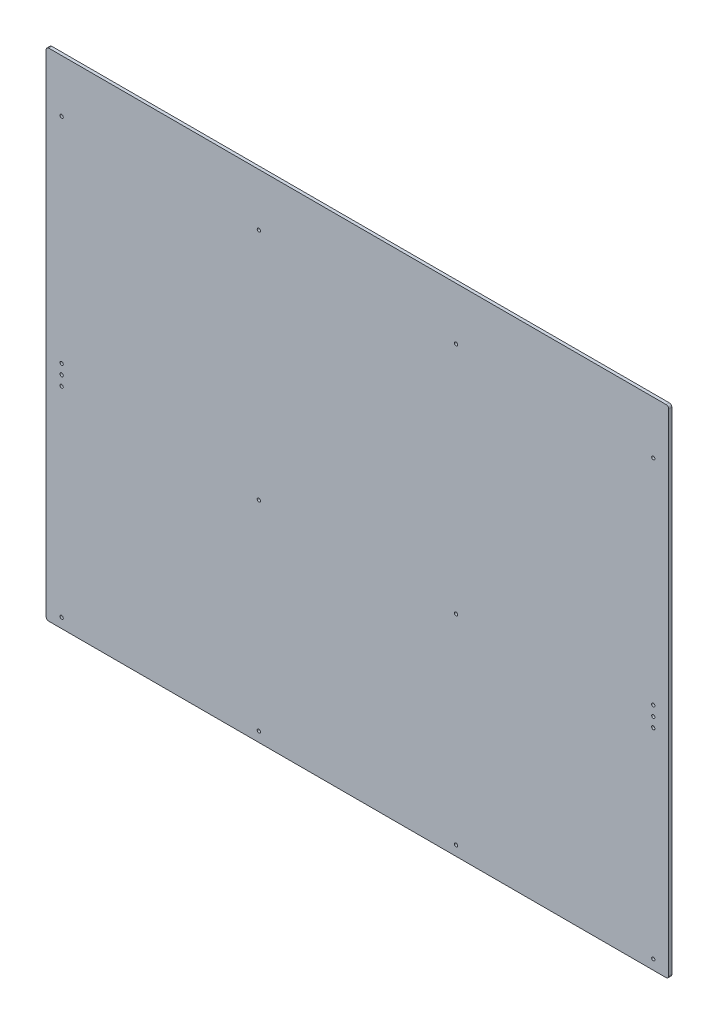
ISO-10303-21;
HEADER;
FILE_DESCRIPTION(('STEP AP214'),'2;1');
FILE_NAME('part.step','',(''),(''),'','','');
FILE_SCHEMA(('AUTOMOTIVE_DESIGN { 1 0 10303 214 1 1 1 1 }'));
ENDSEC;
DATA;
#1=APPLICATION_CONTEXT('core data for automotive mechanical design processes');
#2=APPLICATION_PROTOCOL_DEFINITION('international standard','automotive_design',2000,#1);
#3=PRODUCT_CONTEXT('',#1,'mechanical');
#4=PRODUCT('Part','Part','',(#3));
#5=PRODUCT_RELATED_PRODUCT_CATEGORY('part','',(#4));
#6=PRODUCT_DEFINITION_FORMATION('','',#4);
#7=PRODUCT_DEFINITION_CONTEXT('part definition',#1,'design');
#8=PRODUCT_DEFINITION('design','',#6,#7);
#9=PRODUCT_DEFINITION_SHAPE('','',#8);
#10=(LENGTH_UNIT() NAMED_UNIT(*) SI_UNIT(.MILLI.,.METRE.));
#11=(NAMED_UNIT(*) PLANE_ANGLE_UNIT() SI_UNIT($,.RADIAN.));
#12=(NAMED_UNIT(*) SI_UNIT($,.STERADIAN.) SOLID_ANGLE_UNIT());
#13=UNCERTAINTY_MEASURE_WITH_UNIT(LENGTH_MEASURE(1.E-05),#10,'distance_accuracy_value','');
#14=(GEOMETRIC_REPRESENTATION_CONTEXT(3) GLOBAL_UNCERTAINTY_ASSIGNED_CONTEXT((#13)) GLOBAL_UNIT_ASSIGNED_CONTEXT((#10,
#11,#12)) REPRESENTATION_CONTEXT('',''));
#15=CARTESIAN_POINT('',(0.,0.,0.));
#16=DIRECTION('',(0.,0.,1.));
#17=DIRECTION('',(1.,0.,0.));
#18=AXIS2_PLACEMENT_3D('',#15,#16,#17);
#19=CARTESIAN_POINT('',(0.,0.,3.));
#20=DIRECTION('',(0.,0.,1.));
#21=DIRECTION('',(1.,0.,0.));
#22=AXIS2_PLACEMENT_3D('',#19,#20,#21);
#23=PLANE('',#22);
#24=CARTESIAN_POINT('',(285.75,254.,3.));
#25=DIRECTION('',(0.,0.,1.));
#26=DIRECTION('',(1.,0.,0.));
#27=AXIS2_PLACEMENT_3D('',#24,#25,#26);
#28=CIRCLE('',#27,1.58750000000002);
#29=CARTESIAN_POINT('',(287.3375,254.,3.));
#30=VERTEX_POINT('',#29);
#31=EDGE_CURVE('E90',#30,#30,#28,.F.);
#32=ORIENTED_EDGE('',*,*,#31,.T.);
#33=EDGE_LOOP('',(#32));
#34=FACE_BOUND('',#33,.T.);
#35=CARTESIAN_POINT('',(285.75,-165.1,3.));
#36=DIRECTION('',(0.,0.,1.));
#37=DIRECTION('',(1.,0.,0.));
#38=AXIS2_PLACEMENT_3D('',#35,#36,#37);
#39=CIRCLE('',#38,1.58750000000002);
#40=CARTESIAN_POINT('',(287.3375,-165.1,3.));
#41=VERTEX_POINT('',#40);
#42=EDGE_CURVE('E185',#41,#41,#39,.F.);
#43=ORIENTED_EDGE('',*,*,#42,.T.);
#44=EDGE_LOOP('',(#43));
#45=FACE_BOUND('',#44,.T.);
#46=CARTESIAN_POINT('',(95.25,-165.1,3.));
#47=DIRECTION('',(0.,0.,1.));
#48=DIRECTION('',(1.,0.,0.));
#49=AXIS2_PLACEMENT_3D('',#46,#47,#48);
#50=CIRCLE('',#49,1.58749999999999);
#51=CARTESIAN_POINT('',(96.8375,-165.1,3.));
#52=VERTEX_POINT('',#51);
#53=EDGE_CURVE('E188',#52,#52,#50,.F.);
#54=ORIENTED_EDGE('',*,*,#53,.T.);
#55=EDGE_LOOP('',(#54));
#56=FACE_BOUND('',#55,.T.);
#57=CARTESIAN_POINT('',(-95.25,-165.1,3.));
#58=DIRECTION('',(0.,0.,1.));
#59=DIRECTION('',(1.,0.,0.));
#60=AXIS2_PLACEMENT_3D('',#57,#58,#59);
#61=CIRCLE('',#60,1.58749999999999);
#62=CARTESIAN_POINT('',(-93.6625,-165.1,3.));
#63=VERTEX_POINT('',#62);
#64=EDGE_CURVE('E191',#63,#63,#61,.F.);
#65=ORIENTED_EDGE('',*,*,#64,.T.);
#66=EDGE_LOOP('',(#65));
#67=FACE_BOUND('',#66,.T.);
#68=CARTESIAN_POINT('',(-285.75,-165.1,3.));
#69=DIRECTION('',(0.,0.,1.));
#70=DIRECTION('',(1.,0.,0.));
#71=AXIS2_PLACEMENT_3D('',#68,#69,#70);
#72=CIRCLE('',#71,1.58750000000002);
#73=CARTESIAN_POINT('',(-284.1625,-165.1,3.));
#74=VERTEX_POINT('',#73);
#75=EDGE_CURVE('E194',#74,#74,#72,.F.);
#76=ORIENTED_EDGE('',*,*,#75,.T.);
#77=EDGE_LOOP('',(#76));
#78=FACE_BOUND('',#77,.T.);
#79=CARTESIAN_POINT('',(95.25,254.,3.));
#80=DIRECTION('',(0.,0.,1.));
#81=DIRECTION('',(1.,0.,0.));
#82=AXIS2_PLACEMENT_3D('',#79,#80,#81);
#83=CIRCLE('',#82,1.58749999999999);
#84=CARTESIAN_POINT('',(96.8375,254.,3.));
#85=VERTEX_POINT('',#84);
#86=EDGE_CURVE('E197',#85,#85,#83,.F.);
#87=ORIENTED_EDGE('',*,*,#86,.T.);
#88=EDGE_LOOP('',(#87));
#89=FACE_BOUND('',#88,.T.);
#90=CARTESIAN_POINT('',(-95.25,254.,3.));
#91=DIRECTION('',(0.,0.,1.));
#92=DIRECTION('',(1.,0.,0.));
#93=AXIS2_PLACEMENT_3D('',#90,#91,#92);
#94=CIRCLE('',#93,1.58749999999999);
#95=CARTESIAN_POINT('',(-93.6625,254.,3.));
#96=VERTEX_POINT('',#95);
#97=EDGE_CURVE('E200',#96,#96,#94,.F.);
#98=ORIENTED_EDGE('',*,*,#97,.T.);
#99=EDGE_LOOP('',(#98));
#100=FACE_BOUND('',#99,.T.);
#101=CARTESIAN_POINT('',(-285.75,254.,3.));
#102=DIRECTION('',(0.,0.,1.));
#103=DIRECTION('',(1.,0.,0.));
#104=AXIS2_PLACEMENT_3D('',#101,#102,#103);
#105=CIRCLE('',#104,1.58750000000002);
#106=CARTESIAN_POINT('',(-284.1625,254.,3.));
#107=VERTEX_POINT('',#106);
#108=EDGE_CURVE('E203',#107,#107,#105,.F.);
#109=ORIENTED_EDGE('',*,*,#108,.T.);
#110=EDGE_LOOP('',(#109));
#111=FACE_BOUND('',#110,.T.);
#112=CARTESIAN_POINT('',(-285.75,28.2194,3.));
#113=DIRECTION('',(0.,0.,1.));
#114=DIRECTION('',(1.,0.,0.));
#115=AXIS2_PLACEMENT_3D('',#112,#113,#114);
#116=CIRCLE('',#115,1.58750000000002);
#117=CARTESIAN_POINT('',(-284.1625,28.2194,3.));
#118=VERTEX_POINT('',#117);
#119=EDGE_CURVE('E206',#118,#118,#116,.F.);
#120=ORIENTED_EDGE('',*,*,#119,.T.);
#121=EDGE_LOOP('',(#120));
#122=FACE_BOUND('',#121,.T.);
#123=CARTESIAN_POINT('',(-285.75,37.7444,3.));
#124=DIRECTION('',(0.,0.,1.));
#125=DIRECTION('',(1.,0.,0.));
#126=AXIS2_PLACEMENT_3D('',#123,#124,#125);
#127=CIRCLE('',#126,1.58750000000002);
#128=CARTESIAN_POINT('',(-284.1625,37.7444,3.));
#129=VERTEX_POINT('',#128);
#130=EDGE_CURVE('E209',#129,#129,#127,.F.);
#131=ORIENTED_EDGE('',*,*,#130,.T.);
#132=EDGE_LOOP('',(#131));
#133=FACE_BOUND('',#132,.T.);
#134=CARTESIAN_POINT('',(-285.75,47.2694,3.));
#135=DIRECTION('',(0.,0.,1.));
#136=DIRECTION('',(1.,0.,0.));
#137=AXIS2_PLACEMENT_3D('',#134,#135,#136);
#138=CIRCLE('',#137,1.58750000000002);
#139=CARTESIAN_POINT('',(-284.1625,47.2694,3.));
#140=VERTEX_POINT('',#139);
#141=EDGE_CURVE('E212',#140,#140,#138,.F.);
#142=ORIENTED_EDGE('',*,*,#141,.T.);
#143=EDGE_LOOP('',(#142));
#144=FACE_BOUND('',#143,.T.);
#145=CARTESIAN_POINT('',(-95.25,28.2194,3.));
#146=DIRECTION('',(0.,0.,1.));
#147=DIRECTION('',(1.,0.,0.));
#148=AXIS2_PLACEMENT_3D('',#145,#146,#147);
#149=CIRCLE('',#148,1.58750000000001);
#150=CARTESIAN_POINT('',(-93.6625,28.2194,3.));
#151=VERTEX_POINT('',#150);
#152=EDGE_CURVE('E215',#151,#151,#149,.F.);
#153=ORIENTED_EDGE('',*,*,#152,.T.);
#154=EDGE_LOOP('',(#153));
#155=FACE_BOUND('',#154,.T.);
#156=CARTESIAN_POINT('',(95.25,28.2194,3.));
#157=DIRECTION('',(0.,0.,1.));
#158=DIRECTION('',(1.,0.,0.));
#159=AXIS2_PLACEMENT_3D('',#156,#157,#158);
#160=CIRCLE('',#159,1.58750000000001);
#161=CARTESIAN_POINT('',(96.8375,28.2194,3.));
#162=VERTEX_POINT('',#161);
#163=EDGE_CURVE('E218',#162,#162,#160,.F.);
#164=ORIENTED_EDGE('',*,*,#163,.T.);
#165=EDGE_LOOP('',(#164));
#166=FACE_BOUND('',#165,.T.);
#167=CARTESIAN_POINT('',(285.75,28.2194,3.));
#168=DIRECTION('',(0.,0.,1.));
#169=DIRECTION('',(1.,0.,0.));
#170=AXIS2_PLACEMENT_3D('',#167,#168,#169);
#171=CIRCLE('',#170,1.58750000000002);
#172=CARTESIAN_POINT('',(287.3375,28.2194,3.));
#173=VERTEX_POINT('',#172);
#174=EDGE_CURVE('E221',#173,#173,#171,.F.);
#175=ORIENTED_EDGE('',*,*,#174,.T.);
#176=EDGE_LOOP('',(#175));
#177=FACE_BOUND('',#176,.T.);
#178=CARTESIAN_POINT('',(285.75,37.7444,3.));
#179=DIRECTION('',(0.,0.,1.));
#180=DIRECTION('',(1.,0.,0.));
#181=AXIS2_PLACEMENT_3D('',#178,#179,#180);
#182=CIRCLE('',#181,1.58749999999996);
#183=CARTESIAN_POINT('',(287.3375,37.7444,3.));
#184=VERTEX_POINT('',#183);
#185=EDGE_CURVE('E223',#184,#184,#182,.F.);
#186=ORIENTED_EDGE('',*,*,#185,.T.);
#187=EDGE_LOOP('',(#186));
#188=FACE_BOUND('',#187,.T.);
#189=CARTESIAN_POINT('',(285.75,47.2694,3.));
#190=DIRECTION('',(0.,0.,1.));
#191=DIRECTION('',(1.,0.,0.));
#192=AXIS2_PLACEMENT_3D('',#189,#190,#191);
#193=CIRCLE('',#192,1.58749999999996);
#194=CARTESIAN_POINT('',(287.3375,47.2694,3.));
#195=VERTEX_POINT('',#194);
#196=EDGE_CURVE('E20',#195,#195,#193,.F.);
#197=ORIENTED_EDGE('',*,*,#196,.T.);
#198=EDGE_LOOP('',(#197));
#199=FACE_BOUND('',#198,.T.);
#200=CARTESIAN_POINT('',(-298.1325,302.26,3.));
#201=DIRECTION('',(0.,0.,-1.));
#202=DIRECTION('',(-1.,0.,0.));
#203=AXIS2_PLACEMENT_3D('',#200,#201,#202);
#204=CIRCLE('',#203,2.53999999999999);
#205=CARTESIAN_POINT('',(-300.6725,302.26,3.));
#206=VERTEX_POINT('',#205);
#207=CARTESIAN_POINT('',(-298.1325,304.8,3.));
#208=VERTEX_POINT('',#207);
#209=EDGE_CURVE('E115',#206,#208,#204,.T.);
#210=ORIENTED_EDGE('',*,*,#209,.F.);
#211=DIRECTION('',(0.,1.,0.));
#212=VECTOR('',#211,1.);
#213=CARTESIAN_POINT('',(-300.6725,-304.8,3.));
#214=LINE('',#213,#212);
#215=CARTESIAN_POINT('',(-300.6725,-172.085,2.99999999999992));
#216=VERTEX_POINT('',#215);
#217=EDGE_CURVE('E108',#206,#216,#214,.F.);
#218=ORIENTED_EDGE('',*,*,#217,.T.);
#219=CARTESIAN_POINT('',(-298.1325,-172.085,2.99999999999989));
#220=DIRECTION('',(0.,0.,-1.));
#221=DIRECTION('',(-1.,0.,0.));
#222=AXIS2_PLACEMENT_3D('',#219,#220,#221);
#223=CIRCLE('',#222,2.53999999999999);
#224=CARTESIAN_POINT('',(-298.1325,-174.625,2.99999999999989));
#225=VERTEX_POINT('',#224);
#226=EDGE_CURVE('E111',#225,#216,#223,.T.);
#227=ORIENTED_EDGE('',*,*,#226,.F.);
#228=DIRECTION('',(1.,0.,0.));
#229=VECTOR('',#228,1.);
#230=CARTESIAN_POINT('',(-298.1325,-174.625,2.99999999999989));
#231=LINE('',#230,#229);
#232=CARTESIAN_POINT('',(298.1325,-174.625,2.99999999999989));
#233=VERTEX_POINT('',#232);
#234=EDGE_CURVE('E84',#225,#233,#231,.T.);
#235=ORIENTED_EDGE('',*,*,#234,.T.);
#236=CARTESIAN_POINT('',(298.1325,-172.085,2.99999999999989));
#237=DIRECTION('',(0.,0.,-1.));
#238=DIRECTION('',(-1.,0.,0.));
#239=AXIS2_PLACEMENT_3D('',#236,#237,#238);
#240=CIRCLE('',#239,2.53999999999999);
#241=CARTESIAN_POINT('',(300.6725,-172.085,2.99999999999989));
#242=VERTEX_POINT('',#241);
#243=EDGE_CURVE('E80',#242,#233,#240,.T.);
#244=ORIENTED_EDGE('',*,*,#243,.F.);
#245=DIRECTION('',(0.,1.,0.));
#246=VECTOR('',#245,1.);
#247=CARTESIAN_POINT('',(300.6725,-304.8,2.99999999999989));
#248=LINE('',#247,#246);
#249=CARTESIAN_POINT('',(300.6725,302.26,2.99999999999995));
#250=VERTEX_POINT('',#249);
#251=EDGE_CURVE('E82',#242,#250,#248,.T.);
#252=ORIENTED_EDGE('',*,*,#251,.T.);
#253=CARTESIAN_POINT('',(298.1325,302.26,3.));
#254=DIRECTION('',(0.,0.,-1.));
#255=DIRECTION('',(-1.,0.,0.));
#256=AXIS2_PLACEMENT_3D('',#253,#254,#255);
#257=CIRCLE('',#256,2.53999999999999);
#258=CARTESIAN_POINT('',(298.1325,304.8,3.));
#259=VERTEX_POINT('',#258);
#260=EDGE_CURVE('E97',#259,#250,#257,.T.);
#261=ORIENTED_EDGE('',*,*,#260,.F.);
#262=DIRECTION('',(1.,0.,0.));
#263=VECTOR('',#262,1.);
#264=CARTESIAN_POINT('',(300.6725,304.8,3.));
#265=LINE('',#264,#263);
#266=EDGE_CURVE('E113',#259,#208,#265,.F.);
#267=ORIENTED_EDGE('',*,*,#266,.T.);
#268=EDGE_LOOP('',(#210,#218,#227,#235,#244,#252,#261,#267));
#269=FACE_BOUND('',#268,.T.);
#270=ADVANCED_FACE('F17',(#34,#45,#56,#67,#78,#89,#100,#111,#122,#133,#144,#155,#166,#177,#188,
#199,#269),#23,.T.);
#271=CARTESIAN_POINT('',(285.75,47.2694,0.));
#272=DIRECTION('',(0.,0.,1.));
#273=DIRECTION('',(1.,0.,0.));
#274=AXIS2_PLACEMENT_3D('',#271,#272,#273);
#275=CYLINDRICAL_SURFACE('',#274,1.58749999999996);
#276=CARTESIAN_POINT('',(285.75,47.2694,0.));
#277=DIRECTION('',(0.,0.,1.));
#278=DIRECTION('',(1.,0.,0.));
#279=AXIS2_PLACEMENT_3D('',#276,#277,#278);
#280=CIRCLE('',#279,1.58749999999996);
#281=CARTESIAN_POINT('',(287.3375,47.2694,0.));
#282=VERTEX_POINT('',#281);
#283=EDGE_CURVE('E175',#282,#282,#280,.F.);
#284=ORIENTED_EDGE('',*,*,#283,.T.);
#285=EDGE_LOOP('',(#284));
#286=FACE_BOUND('',#285,.T.);
#287=ORIENTED_EDGE('',*,*,#196,.F.);
#288=EDGE_LOOP('',(#287));
#289=FACE_BOUND('',#288,.T.);
#290=ADVANCED_FACE('F231',(#286,#289),#275,.F.);
#291=CARTESIAN_POINT('',(285.75,37.7444,0.));
#292=DIRECTION('',(0.,0.,1.));
#293=DIRECTION('',(1.,0.,0.));
#294=AXIS2_PLACEMENT_3D('',#291,#292,#293);
#295=CYLINDRICAL_SURFACE('',#294,1.58749999999996);
#296=CARTESIAN_POINT('',(285.75,37.7444,0.));
#297=DIRECTION('',(0.,0.,1.));
#298=DIRECTION('',(1.,0.,0.));
#299=AXIS2_PLACEMENT_3D('',#296,#297,#298);
#300=CIRCLE('',#299,1.58749999999996);
#301=CARTESIAN_POINT('',(287.3375,37.7444,0.));
#302=VERTEX_POINT('',#301);
#303=EDGE_CURVE('E172',#302,#302,#300,.F.);
#304=ORIENTED_EDGE('',*,*,#303,.T.);
#305=EDGE_LOOP('',(#304));
#306=FACE_BOUND('',#305,.T.);
#307=ORIENTED_EDGE('',*,*,#185,.F.);
#308=EDGE_LOOP('',(#307));
#309=FACE_BOUND('',#308,.T.);
#310=ADVANCED_FACE('F233',(#306,#309),#295,.F.);
#311=CARTESIAN_POINT('',(285.75,28.2194,0.));
#312=DIRECTION('',(0.,0.,1.));
#313=DIRECTION('',(1.,0.,0.));
#314=AXIS2_PLACEMENT_3D('',#311,#312,#313);
#315=CYLINDRICAL_SURFACE('',#314,1.58750000000002);
#316=CARTESIAN_POINT('',(285.75,28.2194,0.));
#317=DIRECTION('',(0.,0.,1.));
#318=DIRECTION('',(1.,0.,0.));
#319=AXIS2_PLACEMENT_3D('',#316,#317,#318);
#320=CIRCLE('',#319,1.58750000000002);
#321=CARTESIAN_POINT('',(287.3375,28.2194,0.));
#322=VERTEX_POINT('',#321);
#323=EDGE_CURVE('E169',#322,#322,#320,.F.);
#324=ORIENTED_EDGE('',*,*,#323,.T.);
#325=EDGE_LOOP('',(#324));
#326=FACE_BOUND('',#325,.T.);
#327=ORIENTED_EDGE('',*,*,#174,.F.);
#328=EDGE_LOOP('',(#327));
#329=FACE_BOUND('',#328,.T.);
#330=ADVANCED_FACE('F240',(#326,#329),#315,.F.);
#331=CARTESIAN_POINT('',(95.25,28.2194,0.));
#332=DIRECTION('',(0.,0.,1.));
#333=DIRECTION('',(1.,0.,0.));
#334=AXIS2_PLACEMENT_3D('',#331,#332,#333);
#335=CYLINDRICAL_SURFACE('',#334,1.58750000000001);
#336=CARTESIAN_POINT('',(95.25,28.2194,0.));
#337=DIRECTION('',(0.,0.,1.));
#338=DIRECTION('',(1.,0.,0.));
#339=AXIS2_PLACEMENT_3D('',#336,#337,#338);
#340=CIRCLE('',#339,1.58750000000001);
#341=CARTESIAN_POINT('',(96.8375,28.2194,0.));
#342=VERTEX_POINT('',#341);
#343=EDGE_CURVE('E166',#342,#342,#340,.F.);
#344=ORIENTED_EDGE('',*,*,#343,.T.);
#345=EDGE_LOOP('',(#344));
#346=FACE_BOUND('',#345,.T.);
#347=ORIENTED_EDGE('',*,*,#163,.F.);
#348=EDGE_LOOP('',(#347));
#349=FACE_BOUND('',#348,.T.);
#350=ADVANCED_FACE('F327',(#346,#349),#335,.F.);
#351=CARTESIAN_POINT('',(-95.25,28.2194,0.));
#352=DIRECTION('',(0.,0.,1.));
#353=DIRECTION('',(1.,0.,0.));
#354=AXIS2_PLACEMENT_3D('',#351,#352,#353);
#355=CYLINDRICAL_SURFACE('',#354,1.58750000000001);
#356=CARTESIAN_POINT('',(-95.25,28.2194,0.));
#357=DIRECTION('',(0.,0.,1.));
#358=DIRECTION('',(1.,0.,0.));
#359=AXIS2_PLACEMENT_3D('',#356,#357,#358);
#360=CIRCLE('',#359,1.58750000000001);
#361=CARTESIAN_POINT('',(-93.6625,28.2194,0.));
#362=VERTEX_POINT('',#361);
#363=EDGE_CURVE('E163',#362,#362,#360,.F.);
#364=ORIENTED_EDGE('',*,*,#363,.T.);
#365=EDGE_LOOP('',(#364));
#366=FACE_BOUND('',#365,.T.);
#367=ORIENTED_EDGE('',*,*,#152,.F.);
#368=EDGE_LOOP('',(#367));
#369=FACE_BOUND('',#368,.T.);
#370=ADVANCED_FACE('F323',(#366,#369),#355,.F.);
#371=CARTESIAN_POINT('',(-285.75,47.2694,0.));
#372=DIRECTION('',(0.,0.,1.));
#373=DIRECTION('',(1.,0.,0.));
#374=AXIS2_PLACEMENT_3D('',#371,#372,#373);
#375=CYLINDRICAL_SURFACE('',#374,1.58750000000002);
#376=CARTESIAN_POINT('',(-285.75,47.2694,0.));
#377=DIRECTION('',(0.,0.,1.));
#378=DIRECTION('',(1.,0.,0.));
#379=AXIS2_PLACEMENT_3D('',#376,#377,#378);
#380=CIRCLE('',#379,1.58750000000002);
#381=CARTESIAN_POINT('',(-284.1625,47.2694,0.));
#382=VERTEX_POINT('',#381);
#383=EDGE_CURVE('E160',#382,#382,#380,.F.);
#384=ORIENTED_EDGE('',*,*,#383,.T.);
#385=EDGE_LOOP('',(#384));
#386=FACE_BOUND('',#385,.T.);
#387=ORIENTED_EDGE('',*,*,#141,.F.);
#388=EDGE_LOOP('',(#387));
#389=FACE_BOUND('',#388,.T.);
#390=ADVANCED_FACE('F319',(#386,#389),#375,.F.);
#391=CARTESIAN_POINT('',(-285.75,37.7444,0.));
#392=DIRECTION('',(0.,0.,1.));
#393=DIRECTION('',(1.,0.,0.));
#394=AXIS2_PLACEMENT_3D('',#391,#392,#393);
#395=CYLINDRICAL_SURFACE('',#394,1.58750000000002);
#396=CARTESIAN_POINT('',(-285.75,37.7444,0.));
#397=DIRECTION('',(0.,0.,1.));
#398=DIRECTION('',(1.,0.,0.));
#399=AXIS2_PLACEMENT_3D('',#396,#397,#398);
#400=CIRCLE('',#399,1.58750000000002);
#401=CARTESIAN_POINT('',(-284.1625,37.7444,0.));
#402=VERTEX_POINT('',#401);
#403=EDGE_CURVE('E157',#402,#402,#400,.F.);
#404=ORIENTED_EDGE('',*,*,#403,.T.);
#405=EDGE_LOOP('',(#404));
#406=FACE_BOUND('',#405,.T.);
#407=ORIENTED_EDGE('',*,*,#130,.F.);
#408=EDGE_LOOP('',(#407));
#409=FACE_BOUND('',#408,.T.);
#410=ADVANCED_FACE('F315',(#406,#409),#395,.F.);
#411=CARTESIAN_POINT('',(-285.75,28.2194,0.));
#412=DIRECTION('',(0.,0.,1.));
#413=DIRECTION('',(1.,0.,0.));
#414=AXIS2_PLACEMENT_3D('',#411,#412,#413);
#415=CYLINDRICAL_SURFACE('',#414,1.58750000000002);
#416=CARTESIAN_POINT('',(-285.75,28.2194,0.));
#417=DIRECTION('',(0.,0.,1.));
#418=DIRECTION('',(1.,0.,0.));
#419=AXIS2_PLACEMENT_3D('',#416,#417,#418);
#420=CIRCLE('',#419,1.58750000000002);
#421=CARTESIAN_POINT('',(-284.1625,28.2194,0.));
#422=VERTEX_POINT('',#421);
#423=EDGE_CURVE('E154',#422,#422,#420,.F.);
#424=ORIENTED_EDGE('',*,*,#423,.T.);
#425=EDGE_LOOP('',(#424));
#426=FACE_BOUND('',#425,.T.);
#427=ORIENTED_EDGE('',*,*,#119,.F.);
#428=EDGE_LOOP('',(#427));
#429=FACE_BOUND('',#428,.T.);
#430=ADVANCED_FACE('F311',(#426,#429),#415,.F.);
#431=CARTESIAN_POINT('',(-285.75,254.,0.));
#432=DIRECTION('',(0.,0.,1.));
#433=DIRECTION('',(1.,0.,0.));
#434=AXIS2_PLACEMENT_3D('',#431,#432,#433);
#435=CYLINDRICAL_SURFACE('',#434,1.58750000000002);
#436=CARTESIAN_POINT('',(-285.75,254.,0.));
#437=DIRECTION('',(0.,0.,1.));
#438=DIRECTION('',(1.,0.,0.));
#439=AXIS2_PLACEMENT_3D('',#436,#437,#438);
#440=CIRCLE('',#439,1.58750000000002);
#441=CARTESIAN_POINT('',(-284.1625,254.,0.));
#442=VERTEX_POINT('',#441);
#443=EDGE_CURVE('E151',#442,#442,#440,.F.);
#444=ORIENTED_EDGE('',*,*,#443,.T.);
#445=EDGE_LOOP('',(#444));
#446=FACE_BOUND('',#445,.T.);
#447=ORIENTED_EDGE('',*,*,#108,.F.);
#448=EDGE_LOOP('',(#447));
#449=FACE_BOUND('',#448,.T.);
#450=ADVANCED_FACE('F307',(#446,#449),#435,.F.);
#451=CARTESIAN_POINT('',(-95.25,254.,0.));
#452=DIRECTION('',(0.,0.,1.));
#453=DIRECTION('',(1.,0.,0.));
#454=AXIS2_PLACEMENT_3D('',#451,#452,#453);
#455=CYLINDRICAL_SURFACE('',#454,1.58749999999999);
#456=CARTESIAN_POINT('',(-95.25,254.,0.));
#457=DIRECTION('',(0.,0.,1.));
#458=DIRECTION('',(1.,0.,0.));
#459=AXIS2_PLACEMENT_3D('',#456,#457,#458);
#460=CIRCLE('',#459,1.58749999999999);
#461=CARTESIAN_POINT('',(-93.6625,254.,0.));
#462=VERTEX_POINT('',#461);
#463=EDGE_CURVE('E148',#462,#462,#460,.F.);
#464=ORIENTED_EDGE('',*,*,#463,.T.);
#465=EDGE_LOOP('',(#464));
#466=FACE_BOUND('',#465,.T.);
#467=ORIENTED_EDGE('',*,*,#97,.F.);
#468=EDGE_LOOP('',(#467));
#469=FACE_BOUND('',#468,.T.);
#470=ADVANCED_FACE('F303',(#466,#469),#455,.F.);
#471=CARTESIAN_POINT('',(95.25,254.,0.));
#472=DIRECTION('',(0.,0.,1.));
#473=DIRECTION('',(1.,0.,0.));
#474=AXIS2_PLACEMENT_3D('',#471,#472,#473);
#475=CYLINDRICAL_SURFACE('',#474,1.58749999999999);
#476=CARTESIAN_POINT('',(95.25,254.,0.));
#477=DIRECTION('',(0.,0.,1.));
#478=DIRECTION('',(1.,0.,0.));
#479=AXIS2_PLACEMENT_3D('',#476,#477,#478);
#480=CIRCLE('',#479,1.58749999999999);
#481=CARTESIAN_POINT('',(96.8375,254.,0.));
#482=VERTEX_POINT('',#481);
#483=EDGE_CURVE('E145',#482,#482,#480,.F.);
#484=ORIENTED_EDGE('',*,*,#483,.T.);
#485=EDGE_LOOP('',(#484));
#486=FACE_BOUND('',#485,.T.);
#487=ORIENTED_EDGE('',*,*,#86,.F.);
#488=EDGE_LOOP('',(#487));
#489=FACE_BOUND('',#488,.T.);
#490=ADVANCED_FACE('F299',(#486,#489),#475,.F.);
#491=CARTESIAN_POINT('',(-285.75,-165.1,0.));
#492=DIRECTION('',(0.,0.,1.));
#493=DIRECTION('',(1.,0.,0.));
#494=AXIS2_PLACEMENT_3D('',#491,#492,#493);
#495=CYLINDRICAL_SURFACE('',#494,1.58750000000002);
#496=CARTESIAN_POINT('',(-285.75,-165.1,0.));
#497=DIRECTION('',(0.,0.,1.));
#498=DIRECTION('',(1.,0.,0.));
#499=AXIS2_PLACEMENT_3D('',#496,#497,#498);
#500=CIRCLE('',#499,1.58750000000002);
#501=CARTESIAN_POINT('',(-284.1625,-165.1,0.));
#502=VERTEX_POINT('',#501);
#503=EDGE_CURVE('E142',#502,#502,#500,.F.);
#504=ORIENTED_EDGE('',*,*,#503,.T.);
#505=EDGE_LOOP('',(#504));
#506=FACE_BOUND('',#505,.T.);
#507=ORIENTED_EDGE('',*,*,#75,.F.);
#508=EDGE_LOOP('',(#507));
#509=FACE_BOUND('',#508,.T.);
#510=ADVANCED_FACE('F295',(#506,#509),#495,.F.);
#511=CARTESIAN_POINT('',(-95.25,-165.1,0.));
#512=DIRECTION('',(0.,0.,1.));
#513=DIRECTION('',(1.,0.,0.));
#514=AXIS2_PLACEMENT_3D('',#511,#512,#513);
#515=CYLINDRICAL_SURFACE('',#514,1.58749999999999);
#516=CARTESIAN_POINT('',(-95.25,-165.1,0.));
#517=DIRECTION('',(0.,0.,1.));
#518=DIRECTION('',(1.,0.,0.));
#519=AXIS2_PLACEMENT_3D('',#516,#517,#518);
#520=CIRCLE('',#519,1.58749999999999);
#521=CARTESIAN_POINT('',(-93.6625,-165.1,0.));
#522=VERTEX_POINT('',#521);
#523=EDGE_CURVE('E139',#522,#522,#520,.F.);
#524=ORIENTED_EDGE('',*,*,#523,.T.);
#525=EDGE_LOOP('',(#524));
#526=FACE_BOUND('',#525,.T.);
#527=ORIENTED_EDGE('',*,*,#64,.F.);
#528=EDGE_LOOP('',(#527));
#529=FACE_BOUND('',#528,.T.);
#530=ADVANCED_FACE('F291',(#526,#529),#515,.F.);
#531=CARTESIAN_POINT('',(95.25,-165.1,0.));
#532=DIRECTION('',(0.,0.,1.));
#533=DIRECTION('',(1.,0.,0.));
#534=AXIS2_PLACEMENT_3D('',#531,#532,#533);
#535=CYLINDRICAL_SURFACE('',#534,1.58749999999999);
#536=CARTESIAN_POINT('',(95.25,-165.1,0.));
#537=DIRECTION('',(0.,0.,1.));
#538=DIRECTION('',(1.,0.,0.));
#539=AXIS2_PLACEMENT_3D('',#536,#537,#538);
#540=CIRCLE('',#539,1.58749999999999);
#541=CARTESIAN_POINT('',(96.8375,-165.1,0.));
#542=VERTEX_POINT('',#541);
#543=EDGE_CURVE('E136',#542,#542,#540,.F.);
#544=ORIENTED_EDGE('',*,*,#543,.T.);
#545=EDGE_LOOP('',(#544));
#546=FACE_BOUND('',#545,.T.);
#547=ORIENTED_EDGE('',*,*,#53,.F.);
#548=EDGE_LOOP('',(#547));
#549=FACE_BOUND('',#548,.T.);
#550=ADVANCED_FACE('F287',(#546,#549),#535,.F.);
#551=CARTESIAN_POINT('',(285.75,-165.1,0.));
#552=DIRECTION('',(0.,0.,1.));
#553=DIRECTION('',(1.,0.,0.));
#554=AXIS2_PLACEMENT_3D('',#551,#552,#553);
#555=CYLINDRICAL_SURFACE('',#554,1.58750000000002);
#556=CARTESIAN_POINT('',(285.75,-165.1,0.));
#557=DIRECTION('',(0.,0.,1.));
#558=DIRECTION('',(1.,0.,0.));
#559=AXIS2_PLACEMENT_3D('',#556,#557,#558);
#560=CIRCLE('',#559,1.58750000000002);
#561=CARTESIAN_POINT('',(287.3375,-165.1,0.));
#562=VERTEX_POINT('',#561);
#563=EDGE_CURVE('E133',#562,#562,#560,.F.);
#564=ORIENTED_EDGE('',*,*,#563,.T.);
#565=EDGE_LOOP('',(#564));
#566=FACE_BOUND('',#565,.T.);
#567=ORIENTED_EDGE('',*,*,#42,.F.);
#568=EDGE_LOOP('',(#567));
#569=FACE_BOUND('',#568,.T.);
#570=ADVANCED_FACE('F283',(#566,#569),#555,.F.);
#571=CARTESIAN_POINT('',(285.75,254.,0.));
#572=DIRECTION('',(0.,0.,1.));
#573=DIRECTION('',(1.,0.,0.));
#574=AXIS2_PLACEMENT_3D('',#571,#572,#573);
#575=CYLINDRICAL_SURFACE('',#574,1.58750000000002);
#576=CARTESIAN_POINT('',(285.75,254.,0.));
#577=DIRECTION('',(0.,0.,1.));
#578=DIRECTION('',(1.,0.,0.));
#579=AXIS2_PLACEMENT_3D('',#576,#577,#578);
#580=CIRCLE('',#579,1.58750000000002);
#581=CARTESIAN_POINT('',(287.3375,254.,0.));
#582=VERTEX_POINT('',#581);
#583=EDGE_CURVE('E130',#582,#582,#580,.F.);
#584=ORIENTED_EDGE('',*,*,#583,.T.);
#585=EDGE_LOOP('',(#584));
#586=FACE_BOUND('',#585,.T.);
#587=ORIENTED_EDGE('',*,*,#31,.F.);
#588=EDGE_LOOP('',(#587));
#589=FACE_BOUND('',#588,.T.);
#590=ADVANCED_FACE('F280',(#586,#589),#575,.F.);
#591=CARTESIAN_POINT('',(298.1325,-172.085,1073.3657151187));
#592=DIRECTION('',(0.,0.,-1.));
#593=DIRECTION('',(-1.,0.,0.));
#594=AXIS2_PLACEMENT_3D('',#591,#592,#593);
#595=CYLINDRICAL_SURFACE('',#594,2.53999999999999);
#596=DIRECTION('',(0.,0.,1.));
#597=VECTOR('',#596,1.);
#598=CARTESIAN_POINT('',(298.1325,-174.625,1073.3657151187));
#599=LINE('',#598,#597);
#600=CARTESIAN_POINT('',(298.1325,-174.625,0.));
#601=VERTEX_POINT('',#600);
#602=EDGE_CURVE('E107',#233,#601,#599,.F.);
#603=ORIENTED_EDGE('',*,*,#602,.T.);
#604=CARTESIAN_POINT('',(298.1325,-172.085,0.));
#605=DIRECTION('',(0.,0.,-1.));
#606=DIRECTION('',(-1.,0.,0.));
#607=AXIS2_PLACEMENT_3D('',#604,#605,#606);
#608=CIRCLE('',#607,2.53999999999999);
#609=CARTESIAN_POINT('',(300.6725,-172.085,0.));
#610=VERTEX_POINT('',#609);
#611=EDGE_CURVE('E101',#601,#610,#608,.F.);
#612=ORIENTED_EDGE('',*,*,#611,.T.);
#613=DIRECTION('',(0.,0.,1.));
#614=VECTOR('',#613,1.);
#615=CARTESIAN_POINT('',(300.6725,-172.085,3.));
#616=LINE('',#615,#614);
#617=EDGE_CURVE('E89',#610,#242,#616,.T.);
#618=ORIENTED_EDGE('',*,*,#617,.T.);
#619=ORIENTED_EDGE('',*,*,#243,.T.);
#620=EDGE_LOOP('',(#603,#612,#618,#619));
#621=FACE_BOUND('',#620,.T.);
#622=ADVANCED_FACE('F100',(#621),#595,.T.);
#623=CARTESIAN_POINT('',(300.6725,-304.8,3.));
#624=DIRECTION('',(-1.,0.,0.));
#625=DIRECTION('',(0.,0.,1.));
#626=AXIS2_PLACEMENT_3D('',#623,#624,#625);
#627=PLANE('',#626);
#628=ORIENTED_EDGE('',*,*,#617,.F.);
#629=DIRECTION('',(0.,1.,0.));
#630=VECTOR('',#629,1.);
#631=CARTESIAN_POINT('',(300.6725,0.,0.));
#632=LINE('',#631,#630);
#633=CARTESIAN_POINT('',(300.6725,302.26,0.));
#634=VERTEX_POINT('',#633);
#635=EDGE_CURVE('E128',#610,#634,#632,.T.);
#636=ORIENTED_EDGE('',*,*,#635,.T.);
#637=DIRECTION('',(0.,0.,-1.));
#638=VECTOR('',#637,1.);
#639=CARTESIAN_POINT('',(300.6725,302.26,3.));
#640=LINE('',#639,#638);
#641=EDGE_CURVE('E96',#250,#634,#640,.T.);
#642=ORIENTED_EDGE('',*,*,#641,.F.);
#643=ORIENTED_EDGE('',*,*,#251,.F.);
#644=EDGE_LOOP('',(#628,#636,#642,#643));
#645=FACE_BOUND('',#644,.T.);
#646=ADVANCED_FACE('F93',(#645),#627,.F.);
#647=CARTESIAN_POINT('',(298.1325,302.26,3.));
#648=DIRECTION('',(0.,0.,-1.));
#649=DIRECTION('',(-1.,0.,0.));
#650=AXIS2_PLACEMENT_3D('',#647,#648,#649);
#651=CYLINDRICAL_SURFACE('',#650,2.53999999999999);
#652=CARTESIAN_POINT('',(298.1325,302.26,0.));
#653=DIRECTION('',(0.,0.,-1.));
#654=DIRECTION('',(-1.,0.,0.));
#655=AXIS2_PLACEMENT_3D('',#652,#653,#654);
#656=CIRCLE('',#655,2.53999999999999);
#657=CARTESIAN_POINT('',(298.1325,304.8,0.));
#658=VERTEX_POINT('',#657);
#659=EDGE_CURVE('E125',#634,#658,#656,.F.);
#660=ORIENTED_EDGE('',*,*,#659,.T.);
#661=DIRECTION('',(0.,0.,1.));
#662=VECTOR('',#661,1.);
#663=CARTESIAN_POINT('',(298.1325,304.8,3.));
#664=LINE('',#663,#662);
#665=EDGE_CURVE('E116',#658,#259,#664,.T.);
#666=ORIENTED_EDGE('',*,*,#665,.T.);
#667=ORIENTED_EDGE('',*,*,#260,.T.);
#668=ORIENTED_EDGE('',*,*,#641,.T.);
#669=EDGE_LOOP('',(#660,#666,#667,#668));
#670=FACE_BOUND('',#669,.T.);
#671=ADVANCED_FACE('F271',(#670),#651,.T.);
#672=CARTESIAN_POINT('',(300.6725,304.8,3.));
#673=DIRECTION('',(0.,-1.,0.));
#674=DIRECTION('',(1.,0.,0.));
#675=AXIS2_PLACEMENT_3D('',#672,#673,#674);
#676=PLANE('',#675);
#677=DIRECTION('',(0.,0.,-1.));
#678=VECTOR('',#677,1.);
#679=CARTESIAN_POINT('',(-298.1325,304.8,3.));
#680=LINE('',#679,#678);
#681=CARTESIAN_POINT('',(-298.1325,304.8,0.));
#682=VERTEX_POINT('',#681);
#683=EDGE_CURVE('E181',#208,#682,#680,.T.);
#684=ORIENTED_EDGE('',*,*,#683,.F.);
#685=ORIENTED_EDGE('',*,*,#266,.F.);
#686=ORIENTED_EDGE('',*,*,#665,.F.);
#687=DIRECTION('',(1.,0.,0.));
#688=VECTOR('',#687,1.);
#689=CARTESIAN_POINT('',(0.,304.8,0.));
#690=LINE('',#689,#688);
#691=EDGE_CURVE('E124',#658,#682,#690,.F.);
#692=ORIENTED_EDGE('',*,*,#691,.T.);
#693=EDGE_LOOP('',(#684,#685,#686,#692));
#694=FACE_BOUND('',#693,.T.);
#695=ADVANCED_FACE('F267',(#694),#676,.F.);
#696=CARTESIAN_POINT('',(-298.1325,302.26,3.));
#697=DIRECTION('',(0.,0.,-1.));
#698=DIRECTION('',(-1.,0.,0.));
#699=AXIS2_PLACEMENT_3D('',#696,#697,#698);
#700=CYLINDRICAL_SURFACE('',#699,2.53999999999999);
#701=CARTESIAN_POINT('',(-298.1325,302.26,0.));
#702=DIRECTION('',(0.,0.,-1.));
#703=DIRECTION('',(-1.,0.,0.));
#704=AXIS2_PLACEMENT_3D('',#701,#702,#703);
#705=CIRCLE('',#704,2.53999999999999);
#706=CARTESIAN_POINT('',(-300.6725,302.26,0.));
#707=VERTEX_POINT('',#706);
#708=EDGE_CURVE('E121',#682,#707,#705,.F.);
#709=ORIENTED_EDGE('',*,*,#708,.T.);
#710=DIRECTION('',(0.,0.,-1.));
#711=VECTOR('',#710,1.);
#712=CARTESIAN_POINT('',(-300.6725,302.26,3.));
#713=LINE('',#712,#711);
#714=EDGE_CURVE('E112',#707,#206,#713,.F.);
#715=ORIENTED_EDGE('',*,*,#714,.T.);
#716=ORIENTED_EDGE('',*,*,#209,.T.);
#717=ORIENTED_EDGE('',*,*,#683,.T.);
#718=EDGE_LOOP('',(#709,#715,#716,#717));
#719=FACE_BOUND('',#718,.T.);
#720=ADVANCED_FACE('F263',(#719),#700,.T.);
#721=CARTESIAN_POINT('',(-300.6725,-304.8,3.));
#722=DIRECTION('',(1.,0.,0.));
#723=DIRECTION('',(0.,0.,-1.));
#724=AXIS2_PLACEMENT_3D('',#721,#722,#723);
#725=PLANE('',#724);
#726=DIRECTION('',(0.,0.,-1.));
#727=VECTOR('',#726,1.);
#728=CARTESIAN_POINT('',(-300.6725,-172.085,1073.3657151187));
#729=LINE('',#728,#727);
#730=CARTESIAN_POINT('',(-300.6725,-172.085,0.));
#731=VERTEX_POINT('',#730);
#732=EDGE_CURVE('E179',#216,#731,#729,.T.);
#733=ORIENTED_EDGE('',*,*,#732,.F.);
#734=ORIENTED_EDGE('',*,*,#217,.F.);
#735=ORIENTED_EDGE('',*,*,#714,.F.);
#736=DIRECTION('',(0.,1.,0.));
#737=VECTOR('',#736,1.);
#738=CARTESIAN_POINT('',(-300.6725,0.,0.));
#739=LINE('',#738,#737);
#740=EDGE_CURVE('E120',#707,#731,#739,.F.);
#741=ORIENTED_EDGE('',*,*,#740,.T.);
#742=EDGE_LOOP('',(#733,#734,#735,#741));
#743=FACE_BOUND('',#742,.T.);
#744=ADVANCED_FACE('F259',(#743),#725,.F.);
#745=CARTESIAN_POINT('',(-298.1325,-172.085,1073.3657151187));
#746=DIRECTION('',(0.,0.,-1.));
#747=DIRECTION('',(-1.,0.,0.));
#748=AXIS2_PLACEMENT_3D('',#745,#746,#747);
#749=CYLINDRICAL_SURFACE('',#748,2.53999999999999);
#750=ORIENTED_EDGE('',*,*,#732,.T.);
#751=CARTESIAN_POINT('',(-298.1325,-172.085,0.));
#752=DIRECTION('',(0.,0.,-1.));
#753=DIRECTION('',(-1.,0.,0.));
#754=AXIS2_PLACEMENT_3D('',#751,#752,#753);
#755=CIRCLE('',#754,2.53999999999999);
#756=CARTESIAN_POINT('',(-298.1325,-174.625,0.));
#757=VERTEX_POINT('',#756);
#758=EDGE_CURVE('E26',#731,#757,#755,.F.);
#759=ORIENTED_EDGE('',*,*,#758,.T.);
#760=DIRECTION('',(0.,0.,1.));
#761=VECTOR('',#760,1.);
#762=CARTESIAN_POINT('',(-298.1325,-174.625,1073.3657151187));
#763=LINE('',#762,#761);
#764=EDGE_CURVE('E34',#757,#225,#763,.T.);
#765=ORIENTED_EDGE('',*,*,#764,.T.);
#766=ORIENTED_EDGE('',*,*,#226,.T.);
#767=EDGE_LOOP('',(#750,#759,#765,#766));
#768=FACE_BOUND('',#767,.T.);
#769=ADVANCED_FACE('F252',(#768),#749,.T.);
#770=CARTESIAN_POINT('',(-298.1325,-174.625,1073.3657151187));
#771=DIRECTION('',(0.,1.,0.));
#772=DIRECTION('',(0.,0.,1.));
#773=AXIS2_PLACEMENT_3D('',#770,#771,#772);
#774=PLANE('',#773);
#775=ORIENTED_EDGE('',*,*,#234,.F.);
#776=ORIENTED_EDGE('',*,*,#764,.F.);
#777=DIRECTION('',(1.,0.,0.));
#778=VECTOR('',#777,1.);
#779=CARTESIAN_POINT('',(0.,-174.625,0.));
#780=LINE('',#779,#778);
#781=EDGE_CURVE('E11',#757,#601,#780,.T.);
#782=ORIENTED_EDGE('',*,*,#781,.T.);
#783=ORIENTED_EDGE('',*,*,#602,.F.);
#784=EDGE_LOOP('',(#775,#776,#782,#783));
#785=FACE_BOUND('',#784,.T.);
#786=ADVANCED_FACE('F246',(#785),#774,.F.);
#787=CARTESIAN_POINT('',(0.,0.,0.));
#788=DIRECTION('',(0.,0.,1.));
#789=DIRECTION('',(1.,0.,0.));
#790=AXIS2_PLACEMENT_3D('',#787,#788,#789);
#791=PLANE('',#790);
#792=ORIENTED_EDGE('',*,*,#758,.F.);
#793=ORIENTED_EDGE('',*,*,#740,.F.);
#794=ORIENTED_EDGE('',*,*,#708,.F.);
#795=ORIENTED_EDGE('',*,*,#691,.F.);
#796=ORIENTED_EDGE('',*,*,#659,.F.);
#797=ORIENTED_EDGE('',*,*,#635,.F.);
#798=ORIENTED_EDGE('',*,*,#611,.F.);
#799=ORIENTED_EDGE('',*,*,#781,.F.);
#800=EDGE_LOOP('',(#792,#793,#794,#795,#796,#797,#798,#799));
#801=FACE_BOUND('',#800,.T.);
#802=ORIENTED_EDGE('',*,*,#583,.F.);
#803=EDGE_LOOP('',(#802));
#804=FACE_BOUND('',#803,.T.);
#805=ORIENTED_EDGE('',*,*,#563,.F.);
#806=EDGE_LOOP('',(#805));
#807=FACE_BOUND('',#806,.T.);
#808=ORIENTED_EDGE('',*,*,#543,.F.);
#809=EDGE_LOOP('',(#808));
#810=FACE_BOUND('',#809,.T.);
#811=ORIENTED_EDGE('',*,*,#523,.F.);
#812=EDGE_LOOP('',(#811));
#813=FACE_BOUND('',#812,.T.);
#814=ORIENTED_EDGE('',*,*,#503,.F.);
#815=EDGE_LOOP('',(#814));
#816=FACE_BOUND('',#815,.T.);
#817=ORIENTED_EDGE('',*,*,#483,.F.);
#818=EDGE_LOOP('',(#817));
#819=FACE_BOUND('',#818,.T.);
#820=ORIENTED_EDGE('',*,*,#463,.F.);
#821=EDGE_LOOP('',(#820));
#822=FACE_BOUND('',#821,.T.);
#823=ORIENTED_EDGE('',*,*,#443,.F.);
#824=EDGE_LOOP('',(#823));
#825=FACE_BOUND('',#824,.T.);
#826=ORIENTED_EDGE('',*,*,#423,.F.);
#827=EDGE_LOOP('',(#826));
#828=FACE_BOUND('',#827,.T.);
#829=ORIENTED_EDGE('',*,*,#403,.F.);
#830=EDGE_LOOP('',(#829));
#831=FACE_BOUND('',#830,.T.);
#832=ORIENTED_EDGE('',*,*,#383,.F.);
#833=EDGE_LOOP('',(#832));
#834=FACE_BOUND('',#833,.T.);
#835=ORIENTED_EDGE('',*,*,#363,.F.);
#836=EDGE_LOOP('',(#835));
#837=FACE_BOUND('',#836,.T.);
#838=ORIENTED_EDGE('',*,*,#343,.F.);
#839=EDGE_LOOP('',(#838));
#840=FACE_BOUND('',#839,.T.);
#841=ORIENTED_EDGE('',*,*,#323,.F.);
#842=EDGE_LOOP('',(#841));
#843=FACE_BOUND('',#842,.T.);
#844=ORIENTED_EDGE('',*,*,#303,.F.);
#845=EDGE_LOOP('',(#844));
#846=FACE_BOUND('',#845,.T.);
#847=ORIENTED_EDGE('',*,*,#283,.F.);
#848=EDGE_LOOP('',(#847));
#849=FACE_BOUND('',#848,.T.);
#850=ADVANCED_FACE('F244',(#801,#804,#807,#810,#813,#816,#819,#822,#825,#828,#831,#834,#837,
#840,#843,#846,#849),#791,.F.);
#851=CLOSED_SHELL('',(#270,#290,#310,#330,#350,#370,#390,#410,#430,#450,#470,#490,#510,#530,
#550,#570,#590,#622,#646,#671,#695,#720,#744,#769,#786,#850));
#852=MANIFOLD_SOLID_BREP('B1',#851);
#853=ADVANCED_BREP_SHAPE_REPRESENTATION('',(#18,#852),#14);
#854=SHAPE_DEFINITION_REPRESENTATION(#9,#853);
ENDSEC;
END-ISO-10303-21;
